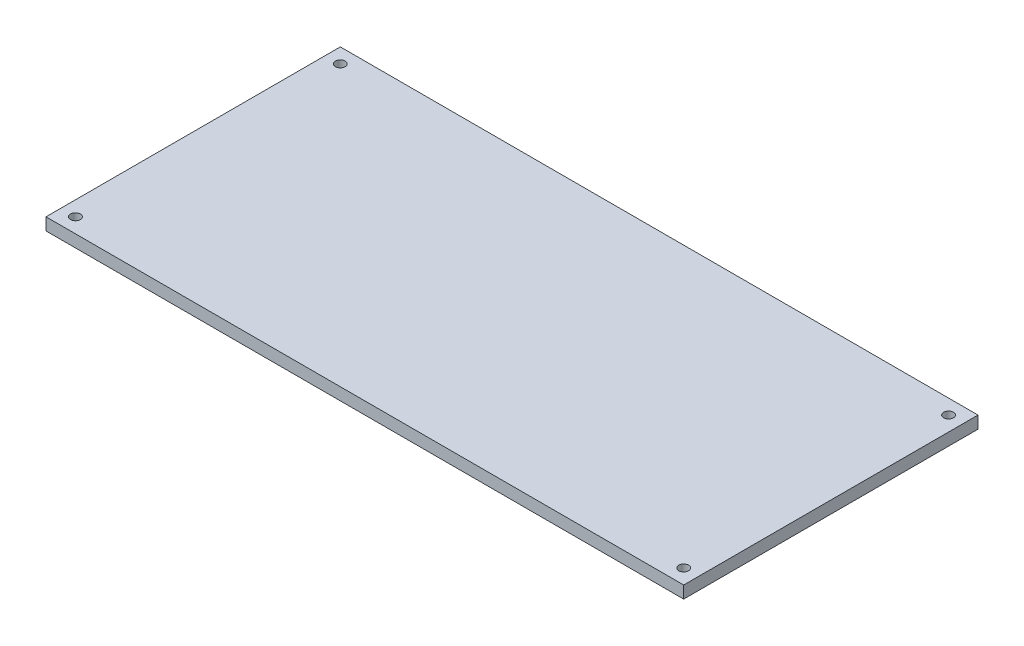
ISO-10303-21;
HEADER;
FILE_DESCRIPTION(('STEP AP214'),'2;1');
FILE_NAME('part.step','',(''),(''),'','','');
FILE_SCHEMA(('AUTOMOTIVE_DESIGN { 1 0 10303 214 1 1 1 1 }'));
ENDSEC;
DATA;
#1=APPLICATION_CONTEXT('core data for automotive mechanical design processes');
#2=APPLICATION_PROTOCOL_DEFINITION('international standard','automotive_design',2000,#1);
#3=PRODUCT_CONTEXT('',#1,'mechanical');
#4=PRODUCT('Part','Part','',(#3));
#5=PRODUCT_RELATED_PRODUCT_CATEGORY('part','',(#4));
#6=PRODUCT_DEFINITION_FORMATION('','',#4);
#7=PRODUCT_DEFINITION_CONTEXT('part definition',#1,'design');
#8=PRODUCT_DEFINITION('design','',#6,#7);
#9=PRODUCT_DEFINITION_SHAPE('','',#8);
#10=(LENGTH_UNIT() NAMED_UNIT(*) SI_UNIT(.MILLI.,.METRE.));
#11=(NAMED_UNIT(*) PLANE_ANGLE_UNIT() SI_UNIT($,.RADIAN.));
#12=(NAMED_UNIT(*) SI_UNIT($,.STERADIAN.) SOLID_ANGLE_UNIT());
#13=UNCERTAINTY_MEASURE_WITH_UNIT(LENGTH_MEASURE(1.E-05),#10,'distance_accuracy_value','');
#14=(GEOMETRIC_REPRESENTATION_CONTEXT(3) GLOBAL_UNCERTAINTY_ASSIGNED_CONTEXT((#13)) GLOBAL_UNIT_ASSIGNED_CONTEXT((#10,
#11,#12)) REPRESENTATION_CONTEXT('',''));
#15=CARTESIAN_POINT('',(0.,0.,0.));
#16=DIRECTION('',(0.,0.,1.));
#17=DIRECTION('',(1.,0.,0.));
#18=AXIS2_PLACEMENT_3D('',#15,#16,#17);
#19=CARTESIAN_POINT('',(65.,2.5,-30.));
#20=DIRECTION('',(-1.,0.,0.));
#21=DIRECTION('',(0.,0.,1.));
#22=AXIS2_PLACEMENT_3D('',#19,#20,#21);
#23=PLANE('',#22);
#24=DIRECTION('',(0.,0.,-1.));
#25=VECTOR('',#24,1.);
#26=CARTESIAN_POINT('',(65.,0.,-30.));
#27=LINE('',#26,#25);
#28=CARTESIAN_POINT('',(65.,0.,30.));
#29=VERTEX_POINT('',#28);
#30=CARTESIAN_POINT('',(65.,0.,-30.));
#31=VERTEX_POINT('',#30);
#32=EDGE_CURVE('E107',#29,#31,#27,.T.);
#33=ORIENTED_EDGE('',*,*,#32,.T.);
#34=DIRECTION('',(0.,-1.,0.));
#35=VECTOR('',#34,1.);
#36=CARTESIAN_POINT('',(65.,2.5,-30.));
#37=LINE('',#36,#35);
#38=CARTESIAN_POINT('',(65.,2.5,-30.));
#39=VERTEX_POINT('',#38);
#40=EDGE_CURVE('E11',#39,#31,#37,.T.);
#41=ORIENTED_EDGE('',*,*,#40,.F.);
#42=DIRECTION('',(0.,0.,-1.));
#43=VECTOR('',#42,1.);
#44=CARTESIAN_POINT('',(65.,2.5,-30.));
#45=LINE('',#44,#43);
#46=CARTESIAN_POINT('',(65.,2.5,30.));
#47=VERTEX_POINT('',#46);
#48=EDGE_CURVE('E91',#47,#39,#45,.T.);
#49=ORIENTED_EDGE('',*,*,#48,.F.);
#50=DIRECTION('',(0.,-1.,0.));
#51=VECTOR('',#50,1.);
#52=CARTESIAN_POINT('',(65.,2.5,30.));
#53=LINE('',#52,#51);
#54=EDGE_CURVE('E103',#47,#29,#53,.T.);
#55=ORIENTED_EDGE('',*,*,#54,.T.);
#56=EDGE_LOOP('',(#33,#41,#49,#55));
#57=FACE_BOUND('',#56,.T.);
#58=ADVANCED_FACE('F39',(#57),#23,.F.);
#59=CARTESIAN_POINT('',(-65.,2.5,-30.));
#60=DIRECTION('',(0.,0.,1.));
#61=DIRECTION('',(1.,0.,0.));
#62=AXIS2_PLACEMENT_3D('',#59,#60,#61);
#63=PLANE('',#62);
#64=DIRECTION('',(-1.,0.,0.));
#65=VECTOR('',#64,1.);
#66=CARTESIAN_POINT('',(-65.,0.,-30.));
#67=LINE('',#66,#65);
#68=CARTESIAN_POINT('',(-65.,0.,-30.));
#69=VERTEX_POINT('',#68);
#70=EDGE_CURVE('E96',#31,#69,#67,.T.);
#71=ORIENTED_EDGE('',*,*,#70,.T.);
#72=DIRECTION('',(0.,-1.,0.));
#73=VECTOR('',#72,1.);
#74=CARTESIAN_POINT('',(-65.,2.5,-30.));
#75=LINE('',#74,#73);
#76=CARTESIAN_POINT('',(-65.,2.5,-30.));
#77=VERTEX_POINT('',#76);
#78=EDGE_CURVE('E48',#77,#69,#75,.T.);
#79=ORIENTED_EDGE('',*,*,#78,.F.);
#80=DIRECTION('',(-1.,0.,0.));
#81=VECTOR('',#80,1.);
#82=CARTESIAN_POINT('',(-65.,2.5,-30.));
#83=LINE('',#82,#81);
#84=EDGE_CURVE('E86',#39,#77,#83,.T.);
#85=ORIENTED_EDGE('',*,*,#84,.F.);
#86=ORIENTED_EDGE('',*,*,#40,.T.);
#87=EDGE_LOOP('',(#71,#79,#85,#86));
#88=FACE_BOUND('',#87,.T.);
#89=ADVANCED_FACE('F95',(#88),#63,.F.);
#90=CARTESIAN_POINT('',(-65.,2.5,-30.));
#91=DIRECTION('',(1.,0.,0.));
#92=DIRECTION('',(0.,0.,-1.));
#93=AXIS2_PLACEMENT_3D('',#90,#91,#92);
#94=PLANE('',#93);
#95=DIRECTION('',(0.,0.,1.));
#96=VECTOR('',#95,1.);
#97=CARTESIAN_POINT('',(-65.,0.,-30.));
#98=LINE('',#97,#96);
#99=CARTESIAN_POINT('',(-65.,0.,30.));
#100=VERTEX_POINT('',#99);
#101=EDGE_CURVE('E73',#69,#100,#98,.T.);
#102=ORIENTED_EDGE('',*,*,#101,.T.);
#103=DIRECTION('',(0.,-1.,0.));
#104=VECTOR('',#103,1.);
#105=CARTESIAN_POINT('',(-65.,2.5,30.));
#106=LINE('',#105,#104);
#107=CARTESIAN_POINT('',(-65.,2.5,30.));
#108=VERTEX_POINT('',#107);
#109=EDGE_CURVE('E98',#108,#100,#106,.T.);
#110=ORIENTED_EDGE('',*,*,#109,.F.);
#111=DIRECTION('',(0.,0.,1.));
#112=VECTOR('',#111,1.);
#113=CARTESIAN_POINT('',(-65.,2.5,-30.));
#114=LINE('',#113,#112);
#115=EDGE_CURVE('E89',#77,#108,#114,.T.);
#116=ORIENTED_EDGE('',*,*,#115,.F.);
#117=ORIENTED_EDGE('',*,*,#78,.T.);
#118=EDGE_LOOP('',(#102,#110,#116,#117));
#119=FACE_BOUND('',#118,.T.);
#120=ADVANCED_FACE('F99',(#119),#94,.F.);
#121=CARTESIAN_POINT('',(-65.,2.5,30.));
#122=DIRECTION('',(0.,0.,-1.));
#123=DIRECTION('',(-1.,0.,0.));
#124=AXIS2_PLACEMENT_3D('',#121,#122,#123);
#125=PLANE('',#124);
#126=DIRECTION('',(1.,0.,0.));
#127=VECTOR('',#126,1.);
#128=CARTESIAN_POINT('',(-65.,0.,30.));
#129=LINE('',#128,#127);
#130=EDGE_CURVE('E79',#100,#29,#129,.T.);
#131=ORIENTED_EDGE('',*,*,#130,.T.);
#132=ORIENTED_EDGE('',*,*,#54,.F.);
#133=DIRECTION('',(1.,0.,0.));
#134=VECTOR('',#133,1.);
#135=CARTESIAN_POINT('',(-65.,2.5,30.));
#136=LINE('',#135,#134);
#137=EDGE_CURVE('E56',#108,#47,#136,.T.);
#138=ORIENTED_EDGE('',*,*,#137,.F.);
#139=ORIENTED_EDGE('',*,*,#109,.T.);
#140=EDGE_LOOP('',(#131,#132,#138,#139));
#141=FACE_BOUND('',#140,.T.);
#142=ADVANCED_FACE('F121',(#141),#125,.F.);
#143=CARTESIAN_POINT('',(0.,2.5,0.));
#144=DIRECTION('',(0.,1.,0.));
#145=DIRECTION('',(0.,0.,1.));
#146=AXIS2_PLACEMENT_3D('',#143,#144,#145);
#147=PLANE('',#146);
#148=CARTESIAN_POINT('',(-62.,2.5,27.));
#149=DIRECTION('',(0.,1.,0.));
#150=DIRECTION('',(0.,0.,-1.));
#151=AXIS2_PLACEMENT_3D('',#148,#149,#150);
#152=CIRCLE('',#151,0.999999999999998);
#153=CARTESIAN_POINT('',(-62.,2.5,26.));
#154=VERTEX_POINT('',#153);
#155=EDGE_CURVE('E141',#154,#154,#152,.T.);
#156=ORIENTED_EDGE('',*,*,#155,.F.);
#157=EDGE_LOOP('',(#156));
#158=FACE_BOUND('',#157,.T.);
#159=CARTESIAN_POINT('',(62.,2.5,27.));
#160=DIRECTION('',(0.,1.,0.));
#161=DIRECTION('',(0.,0.,1.));
#162=AXIS2_PLACEMENT_3D('',#159,#160,#161);
#163=CIRCLE('',#162,0.999999999999998);
#164=CARTESIAN_POINT('',(62.,2.5,28.));
#165=VERTEX_POINT('',#164);
#166=EDGE_CURVE('E140',#165,#165,#163,.T.);
#167=ORIENTED_EDGE('',*,*,#166,.F.);
#168=EDGE_LOOP('',(#167));
#169=FACE_BOUND('',#168,.T.);
#170=CARTESIAN_POINT('',(62.,2.5,-27.));
#171=DIRECTION('',(0.,1.,0.));
#172=DIRECTION('',(0.,0.,-1.));
#173=AXIS2_PLACEMENT_3D('',#170,#171,#172);
#174=CIRCLE('',#173,0.999999999999998);
#175=CARTESIAN_POINT('',(62.,2.5,-28.));
#176=VERTEX_POINT('',#175);
#177=EDGE_CURVE('E149',#176,#176,#174,.T.);
#178=ORIENTED_EDGE('',*,*,#177,.F.);
#179=EDGE_LOOP('',(#178));
#180=FACE_BOUND('',#179,.T.);
#181=CARTESIAN_POINT('',(-62.,2.5,-27.));
#182=DIRECTION('',(0.,1.,0.));
#183=DIRECTION('',(0.,0.,1.));
#184=AXIS2_PLACEMENT_3D('',#181,#182,#183);
#185=CIRCLE('',#184,0.999999999999998);
#186=CARTESIAN_POINT('',(-62.,2.5,-26.));
#187=VERTEX_POINT('',#186);
#188=EDGE_CURVE('E131',#187,#187,#185,.T.);
#189=ORIENTED_EDGE('',*,*,#188,.F.);
#190=EDGE_LOOP('',(#189));
#191=FACE_BOUND('',#190,.T.);
#192=ORIENTED_EDGE('',*,*,#48,.T.);
#193=ORIENTED_EDGE('',*,*,#84,.T.);
#194=ORIENTED_EDGE('',*,*,#115,.T.);
#195=ORIENTED_EDGE('',*,*,#137,.T.);
#196=EDGE_LOOP('',(#192,#193,#194,#195));
#197=FACE_BOUND('',#196,.T.);
#198=ADVANCED_FACE('F87',(#158,#169,#180,#191,#197),#147,.T.);
#199=CARTESIAN_POINT('',(0.,0.,0.));
#200=DIRECTION('',(0.,1.,0.));
#201=DIRECTION('',(0.,0.,1.));
#202=AXIS2_PLACEMENT_3D('',#199,#200,#201);
#203=PLANE('',#202);
#204=CARTESIAN_POINT('',(-62.,0.,27.));
#205=DIRECTION('',(0.,1.,0.));
#206=DIRECTION('',(0.,0.,1.));
#207=AXIS2_PLACEMENT_3D('',#204,#205,#206);
#208=CIRCLE('',#207,0.999999999999998);
#209=CARTESIAN_POINT('',(-62.,0.,28.));
#210=VERTEX_POINT('',#209);
#211=EDGE_CURVE('E136',#210,#210,#208,.F.);
#212=ORIENTED_EDGE('',*,*,#211,.F.);
#213=EDGE_LOOP('',(#212));
#214=FACE_BOUND('',#213,.T.);
#215=CARTESIAN_POINT('',(62.,0.,27.));
#216=DIRECTION('',(0.,1.,0.));
#217=DIRECTION('',(0.,0.,1.));
#218=AXIS2_PLACEMENT_3D('',#215,#216,#217);
#219=CIRCLE('',#218,0.999999999999998);
#220=CARTESIAN_POINT('',(62.,0.,28.));
#221=VERTEX_POINT('',#220);
#222=EDGE_CURVE('E145',#221,#221,#219,.F.);
#223=ORIENTED_EDGE('',*,*,#222,.F.);
#224=EDGE_LOOP('',(#223));
#225=FACE_BOUND('',#224,.T.);
#226=CARTESIAN_POINT('',(62.,0.,-27.));
#227=DIRECTION('',(0.,1.,0.));
#228=DIRECTION('',(0.,0.,1.));
#229=AXIS2_PLACEMENT_3D('',#226,#227,#228);
#230=CIRCLE('',#229,0.999999999999998);
#231=CARTESIAN_POINT('',(62.,0.,-26.));
#232=VERTEX_POINT('',#231);
#233=EDGE_CURVE('E135',#232,#232,#230,.F.);
#234=ORIENTED_EDGE('',*,*,#233,.F.);
#235=EDGE_LOOP('',(#234));
#236=FACE_BOUND('',#235,.T.);
#237=CARTESIAN_POINT('',(-62.,0.,-27.));
#238=DIRECTION('',(0.,1.,0.));
#239=DIRECTION('',(0.,0.,1.));
#240=AXIS2_PLACEMENT_3D('',#237,#238,#239);
#241=CIRCLE('',#240,0.999999999999998);
#242=CARTESIAN_POINT('',(-62.,0.,-26.));
#243=VERTEX_POINT('',#242);
#244=EDGE_CURVE('E111',#243,#243,#241,.F.);
#245=ORIENTED_EDGE('',*,*,#244,.F.);
#246=EDGE_LOOP('',(#245));
#247=FACE_BOUND('',#246,.T.);
#248=ORIENTED_EDGE('',*,*,#32,.F.);
#249=ORIENTED_EDGE('',*,*,#130,.F.);
#250=ORIENTED_EDGE('',*,*,#101,.F.);
#251=ORIENTED_EDGE('',*,*,#70,.F.);
#252=EDGE_LOOP('',(#248,#249,#250,#251));
#253=FACE_BOUND('',#252,.T.);
#254=ADVANCED_FACE('F124',(#214,#225,#236,#247,#253),#203,.F.);
#255=CARTESIAN_POINT('',(-62.,-0.00100000000000013,-27.));
#256=DIRECTION('',(0.,1.,0.));
#257=DIRECTION('',(0.,0.,1.));
#258=AXIS2_PLACEMENT_3D('',#255,#256,#257);
#259=CYLINDRICAL_SURFACE('',#258,0.999999999999998);
#260=ORIENTED_EDGE('',*,*,#188,.T.);
#261=EDGE_LOOP('',(#260));
#262=FACE_BOUND('',#261,.T.);
#263=ORIENTED_EDGE('',*,*,#244,.T.);
#264=EDGE_LOOP('',(#263));
#265=FACE_BOUND('',#264,.T.);
#266=ADVANCED_FACE('F169',(#262,#265),#259,.F.);
#267=CARTESIAN_POINT('',(62.,-0.00100000000000013,-27.));
#268=DIRECTION('',(0.,1.,0.));
#269=DIRECTION('',(0.,0.,1.));
#270=AXIS2_PLACEMENT_3D('',#267,#268,#269);
#271=CYLINDRICAL_SURFACE('',#270,0.999999999999998);
#272=ORIENTED_EDGE('',*,*,#177,.T.);
#273=EDGE_LOOP('',(#272));
#274=FACE_BOUND('',#273,.T.);
#275=ORIENTED_EDGE('',*,*,#233,.T.);
#276=EDGE_LOOP('',(#275));
#277=FACE_BOUND('',#276,.T.);
#278=ADVANCED_FACE('F160',(#274,#277),#271,.F.);
#279=CARTESIAN_POINT('',(62.,-0.00100000000000013,27.));
#280=DIRECTION('',(0.,1.,0.));
#281=DIRECTION('',(0.,0.,1.));
#282=AXIS2_PLACEMENT_3D('',#279,#280,#281);
#283=CYLINDRICAL_SURFACE('',#282,0.999999999999998);
#284=ORIENTED_EDGE('',*,*,#166,.T.);
#285=EDGE_LOOP('',(#284));
#286=FACE_BOUND('',#285,.T.);
#287=ORIENTED_EDGE('',*,*,#222,.T.);
#288=EDGE_LOOP('',(#287));
#289=FACE_BOUND('',#288,.T.);
#290=ADVANCED_FACE('F219',(#286,#289),#283,.F.);
#291=CARTESIAN_POINT('',(-62.,-0.00100000000000013,27.));
#292=DIRECTION('',(0.,1.,0.));
#293=DIRECTION('',(0.,0.,1.));
#294=AXIS2_PLACEMENT_3D('',#291,#292,#293);
#295=CYLINDRICAL_SURFACE('',#294,0.999999999999998);
#296=ORIENTED_EDGE('',*,*,#155,.T.);
#297=EDGE_LOOP('',(#296));
#298=FACE_BOUND('',#297,.T.);
#299=ORIENTED_EDGE('',*,*,#211,.T.);
#300=EDGE_LOOP('',(#299));
#301=FACE_BOUND('',#300,.T.);
#302=ADVANCED_FACE('F228',(#298,#301),#295,.F.);
#303=CLOSED_SHELL('',(#58,#89,#120,#142,#198,#254,#266,#278,#290,#302));
#304=MANIFOLD_SOLID_BREP('B2',#303);
#305=ADVANCED_BREP_SHAPE_REPRESENTATION('',(#18,#304),#14);
#306=SHAPE_DEFINITION_REPRESENTATION(#9,#305);
ENDSEC;
END-ISO-10303-21;
